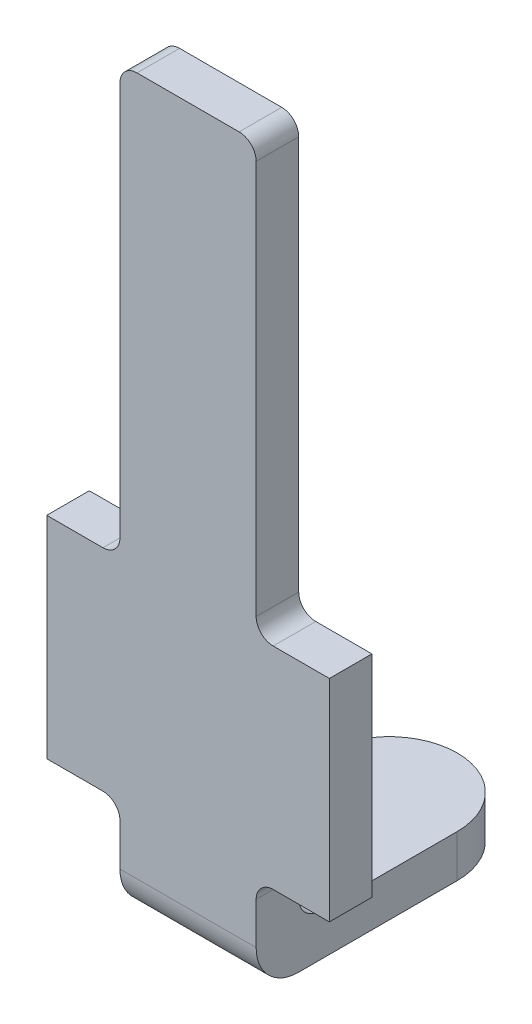
ISO-10303-21;
HEADER;
FILE_DESCRIPTION(('STEP AP214'),'2;1');
FILE_NAME('part.step','',(''),(''),'','','');
FILE_SCHEMA(('AUTOMOTIVE_DESIGN { 1 0 10303 214 1 1 1 1 }'));
ENDSEC;
DATA;
#1=APPLICATION_CONTEXT('core data for automotive mechanical design processes');
#2=APPLICATION_PROTOCOL_DEFINITION('international standard','automotive_design',2000,#1);
#3=PRODUCT_CONTEXT('',#1,'mechanical');
#4=PRODUCT('Part','Part','',(#3));
#5=PRODUCT_RELATED_PRODUCT_CATEGORY('part','',(#4));
#6=PRODUCT_DEFINITION_FORMATION('','',#4);
#7=PRODUCT_DEFINITION_CONTEXT('part definition',#1,'design');
#8=PRODUCT_DEFINITION('design','',#6,#7);
#9=PRODUCT_DEFINITION_SHAPE('','',#8);
#10=(LENGTH_UNIT() NAMED_UNIT(*) SI_UNIT(.MILLI.,.METRE.));
#11=(NAMED_UNIT(*) PLANE_ANGLE_UNIT() SI_UNIT($,.RADIAN.));
#12=(NAMED_UNIT(*) SI_UNIT($,.STERADIAN.) SOLID_ANGLE_UNIT());
#13=UNCERTAINTY_MEASURE_WITH_UNIT(LENGTH_MEASURE(1.E-05),#10,'distance_accuracy_value','');
#14=(GEOMETRIC_REPRESENTATION_CONTEXT(3) GLOBAL_UNCERTAINTY_ASSIGNED_CONTEXT((#13)) GLOBAL_UNIT_ASSIGNED_CONTEXT((#10,
#11,#12)) REPRESENTATION_CONTEXT('',''));
#15=CARTESIAN_POINT('',(0.,0.,0.));
#16=DIRECTION('',(0.,0.,1.));
#17=DIRECTION('',(1.,0.,0.));
#18=AXIS2_PLACEMENT_3D('',#15,#16,#17);
#19=CARTESIAN_POINT('',(0.77,1.48437551370885,-0.748999999999983));
#20=DIRECTION('',(0.,0.,-1.));
#21=DIRECTION('',(1.,0.,0.));
#22=AXIS2_PLACEMENT_3D('',#19,#20,#21);
#23=CYLINDRICAL_SURFACE('',#22,0.1);
#24=CARTESIAN_POINT('',(0.77,1.48437551370885,-0.498999999999983));
#25=DIRECTION('',(0.,0.,1.));
#26=DIRECTION('',(1.,0.,0.));
#27=AXIS2_PLACEMENT_3D('',#24,#25,#26);
#28=CIRCLE('',#27,0.1);
#29=CARTESIAN_POINT('',(0.77,1.38437551370885,-0.499000000000012));
#30=VERTEX_POINT('',#29);
#31=CARTESIAN_POINT('',(0.87,1.48437551370885,-0.498999999999983));
#32=VERTEX_POINT('',#31);
#33=EDGE_CURVE('E243',#30,#32,#28,.T.);
#34=ORIENTED_EDGE('',*,*,#33,.T.);
#35=DIRECTION('',(0.,0.,-1.));
#36=VECTOR('',#35,1.);
#37=CARTESIAN_POINT('',(0.87,1.48437551370885,-0.748999999999983));
#38=LINE('',#37,#36);
#39=CARTESIAN_POINT('',(0.87,1.48437551370885,-0.748999999999983));
#40=VERTEX_POINT('',#39);
#41=EDGE_CURVE('E308',#32,#40,#38,.T.);
#42=ORIENTED_EDGE('',*,*,#41,.T.);
#43=CARTESIAN_POINT('',(0.77,1.48437551370885,-0.748999999999983));
#44=DIRECTION('',(0.,0.,-1.));
#45=DIRECTION('',(-1.,0.,0.));
#46=AXIS2_PLACEMENT_3D('',#43,#44,#45);
#47=CIRCLE('',#46,0.1);
#48=CARTESIAN_POINT('',(0.77,1.38437551370885,-0.749000000000012));
#49=VERTEX_POINT('',#48);
#50=EDGE_CURVE('E285',#40,#49,#47,.T.);
#51=ORIENTED_EDGE('',*,*,#50,.T.);
#52=DIRECTION('',(0.,0.,1.));
#53=VECTOR('',#52,1.);
#54=CARTESIAN_POINT('',(0.77,1.38437551370885,-0.749000000000012));
#55=LINE('',#54,#53);
#56=EDGE_CURVE('E191',#49,#30,#55,.T.);
#57=ORIENTED_EDGE('',*,*,#56,.T.);
#58=EDGE_LOOP('',(#34,#42,#51,#57));
#59=FACE_BOUND('',#58,.T.);
#60=ADVANCED_FACE('F16',(#59),#23,.F.);
#61=CARTESIAN_POINT('',(1.77,1.48437551370885,-0.749000000000014));
#62=DIRECTION('',(0.,0.,1.));
#63=DIRECTION('',(-1.,0.,0.));
#64=AXIS2_PLACEMENT_3D('',#61,#62,#63);
#65=CYLINDRICAL_SURFACE('',#64,0.1);
#66=CARTESIAN_POINT('',(1.77,1.48437551370885,-0.498999999999985));
#67=DIRECTION('',(0.,0.,1.));
#68=DIRECTION('',(1.,0.,0.));
#69=AXIS2_PLACEMENT_3D('',#66,#67,#68);
#70=CIRCLE('',#69,0.1);
#71=CARTESIAN_POINT('',(1.67,1.48437551370885,-0.498999999999984));
#72=VERTEX_POINT('',#71);
#73=CARTESIAN_POINT('',(1.77,1.38437551370885,-0.499000000000013));
#74=VERTEX_POINT('',#73);
#75=EDGE_CURVE('E295',#72,#74,#70,.T.);
#76=ORIENTED_EDGE('',*,*,#75,.T.);
#77=DIRECTION('',(0.,0.,-1.));
#78=VECTOR('',#77,1.);
#79=CARTESIAN_POINT('',(1.77,1.38437551370885,-0.748999999999984));
#80=LINE('',#79,#78);
#81=CARTESIAN_POINT('',(1.77,1.38437551370885,-0.749000000000014));
#82=VERTEX_POINT('',#81);
#83=EDGE_CURVE('E41',#74,#82,#80,.T.);
#84=ORIENTED_EDGE('',*,*,#83,.T.);
#85=CARTESIAN_POINT('',(1.77,1.48437551370885,-0.748999999999984));
#86=DIRECTION('',(0.,0.,-1.));
#87=DIRECTION('',(-1.,0.,0.));
#88=AXIS2_PLACEMENT_3D('',#85,#86,#87);
#89=CIRCLE('',#88,0.1);
#90=CARTESIAN_POINT('',(1.67,1.48437551370885,-0.748999999999984));
#91=VERTEX_POINT('',#90);
#92=EDGE_CURVE('E424',#82,#91,#89,.T.);
#93=ORIENTED_EDGE('',*,*,#92,.T.);
#94=DIRECTION('',(0.,0.,1.));
#95=VECTOR('',#94,1.);
#96=CARTESIAN_POINT('',(1.67,1.48437551370885,-0.498999999999984));
#97=LINE('',#96,#95);
#98=EDGE_CURVE('E289',#91,#72,#97,.T.);
#99=ORIENTED_EDGE('',*,*,#98,.T.);
#100=EDGE_LOOP('',(#76,#84,#93,#99));
#101=FACE_BOUND('',#100,.T.);
#102=ADVANCED_FACE('F678',(#101),#65,.F.);
#103=CARTESIAN_POINT('',(0.77,0.0459658151929143,-0.749000000000012));
#104=DIRECTION('',(0.,0.,1.));
#105=DIRECTION('',(-1.,0.,0.));
#106=AXIS2_PLACEMENT_3D('',#103,#104,#105);
#107=CYLINDRICAL_SURFACE('',#106,0.1);
#108=CARTESIAN_POINT('',(0.77,0.0459658151929143,-0.498999999999983));
#109=DIRECTION('',(0.,0.,1.));
#110=DIRECTION('',(1.,0.,0.));
#111=AXIS2_PLACEMENT_3D('',#108,#109,#110);
#112=CIRCLE('',#111,0.1);
#113=CARTESIAN_POINT('',(0.87,0.0459658151929143,-0.498999999999983));
#114=VERTEX_POINT('',#113);
#115=CARTESIAN_POINT('',(0.77,0.145965815192914,-0.499000000000012));
#116=VERTEX_POINT('',#115);
#117=EDGE_CURVE('E299',#114,#116,#112,.T.);
#118=ORIENTED_EDGE('',*,*,#117,.T.);
#119=DIRECTION('',(0.,0.,-1.));
#120=VECTOR('',#119,1.);
#121=CARTESIAN_POINT('',(0.77,0.145965815192914,-0.748999999999983));
#122=LINE('',#121,#120);
#123=CARTESIAN_POINT('',(0.77,0.145965815192914,-0.749000000000012));
#124=VERTEX_POINT('',#123);
#125=EDGE_CURVE('E398',#116,#124,#122,.T.);
#126=ORIENTED_EDGE('',*,*,#125,.T.);
#127=CARTESIAN_POINT('',(0.77,0.0459658151929143,-0.748999999999983));
#128=DIRECTION('',(0.,0.,-1.));
#129=DIRECTION('',(-1.,0.,0.));
#130=AXIS2_PLACEMENT_3D('',#127,#128,#129);
#131=CIRCLE('',#130,0.1);
#132=CARTESIAN_POINT('',(0.87,0.0459658151929143,-0.748999999999983));
#133=VERTEX_POINT('',#132);
#134=EDGE_CURVE('E340',#124,#133,#131,.T.);
#135=ORIENTED_EDGE('',*,*,#134,.T.);
#136=DIRECTION('',(0.,0.,1.));
#137=VECTOR('',#136,1.);
#138=CARTESIAN_POINT('',(0.87,0.0459658151929143,-0.499000000000012));
#139=LINE('',#138,#137);
#140=EDGE_CURVE('E370',#133,#114,#139,.T.);
#141=ORIENTED_EDGE('',*,*,#140,.T.);
#142=EDGE_LOOP('',(#118,#126,#135,#141));
#143=FACE_BOUND('',#142,.T.);
#144=ADVANCED_FACE('F682',(#143),#107,.F.);
#145=CARTESIAN_POINT('',(1.77,0.0459658151929143,-0.748999999999984));
#146=DIRECTION('',(0.,0.,-1.));
#147=DIRECTION('',(1.,0.,0.));
#148=AXIS2_PLACEMENT_3D('',#145,#146,#147);
#149=CYLINDRICAL_SURFACE('',#148,0.1);
#150=CARTESIAN_POINT('',(1.77,0.0459658151929143,-0.498999999999984));
#151=DIRECTION('',(0.,0.,1.));
#152=DIRECTION('',(1.,0.,0.));
#153=AXIS2_PLACEMENT_3D('',#150,#151,#152);
#154=CIRCLE('',#153,0.1);
#155=CARTESIAN_POINT('',(1.77,0.145965815192914,-0.499000000000013));
#156=VERTEX_POINT('',#155);
#157=CARTESIAN_POINT('',(1.67,0.0459658151929143,-0.498999999999984));
#158=VERTEX_POINT('',#157);
#159=EDGE_CURVE('E430',#156,#158,#154,.T.);
#160=ORIENTED_EDGE('',*,*,#159,.T.);
#161=DIRECTION('',(0.,0.,-1.));
#162=VECTOR('',#161,1.);
#163=CARTESIAN_POINT('',(1.67,0.0459658151929143,-0.748999999999984));
#164=LINE('',#163,#162);
#165=CARTESIAN_POINT('',(1.67,0.0459658151929143,-0.748999999999984));
#166=VERTEX_POINT('',#165);
#167=EDGE_CURVE('E276',#158,#166,#164,.T.);
#168=ORIENTED_EDGE('',*,*,#167,.T.);
#169=CARTESIAN_POINT('',(1.77,0.0459658151929143,-0.748999999999984));
#170=DIRECTION('',(0.,0.,-1.));
#171=DIRECTION('',(-1.,0.,0.));
#172=AXIS2_PLACEMENT_3D('',#169,#170,#171);
#173=CIRCLE('',#172,0.1);
#174=CARTESIAN_POINT('',(1.77,0.145965815192914,-0.749000000000013));
#175=VERTEX_POINT('',#174);
#176=EDGE_CURVE('E441',#166,#175,#173,.T.);
#177=ORIENTED_EDGE('',*,*,#176,.T.);
#178=DIRECTION('',(0.,0.,1.));
#179=VECTOR('',#178,1.);
#180=CARTESIAN_POINT('',(1.77,0.145965815192914,-0.749000000000013));
#181=LINE('',#180,#179);
#182=EDGE_CURVE('E11',#175,#156,#181,.T.);
#183=ORIENTED_EDGE('',*,*,#182,.T.);
#184=EDGE_LOOP('',(#160,#168,#177,#183));
#185=FACE_BOUND('',#184,.T.);
#186=ADVANCED_FACE('F735',(#185),#149,.F.);
#187=CARTESIAN_POINT('',(0.97,3.8,-0.748999999999983));
#188=DIRECTION('',(0.,0.,1.));
#189=DIRECTION('',(-1.,0.,0.));
#190=AXIS2_PLACEMENT_3D('',#187,#188,#189);
#191=CYLINDRICAL_SURFACE('',#190,0.1);
#192=CARTESIAN_POINT('',(0.97,3.8,-0.498999999999984));
#193=DIRECTION('',(0.,0.,-1.));
#194=DIRECTION('',(1.,0.,0.));
#195=AXIS2_PLACEMENT_3D('',#192,#193,#194);
#196=CIRCLE('',#195,0.1);
#197=CARTESIAN_POINT('',(0.87,3.8,-0.498999999999984));
#198=VERTEX_POINT('',#197);
#199=CARTESIAN_POINT('',(0.97,3.9,-0.498999999999984));
#200=VERTEX_POINT('',#199);
#201=EDGE_CURVE('E231',#198,#200,#196,.T.);
#202=ORIENTED_EDGE('',*,*,#201,.T.);
#203=DIRECTION('',(0.,0.,-1.));
#204=VECTOR('',#203,1.);
#205=CARTESIAN_POINT('',(0.97,3.9,-0.748999999999983));
#206=LINE('',#205,#204);
#207=CARTESIAN_POINT('',(0.97,3.9,-0.748999999999983));
#208=VERTEX_POINT('',#207);
#209=EDGE_CURVE('E235',#200,#208,#206,.T.);
#210=ORIENTED_EDGE('',*,*,#209,.T.);
#211=CARTESIAN_POINT('',(0.97,3.8,-0.748999999999983));
#212=DIRECTION('',(0.,0.,1.));
#213=DIRECTION('',(-1.,0.,0.));
#214=AXIS2_PLACEMENT_3D('',#211,#212,#213);
#215=CIRCLE('',#214,0.1);
#216=CARTESIAN_POINT('',(0.87,3.8,-0.748999999999983));
#217=VERTEX_POINT('',#216);
#218=EDGE_CURVE('E281',#208,#217,#215,.T.);
#219=ORIENTED_EDGE('',*,*,#218,.T.);
#220=DIRECTION('',(0.,0.,1.));
#221=VECTOR('',#220,1.);
#222=CARTESIAN_POINT('',(0.87,3.8,-0.498999999999984));
#223=LINE('',#222,#221);
#224=EDGE_CURVE('E238',#217,#198,#223,.T.);
#225=ORIENTED_EDGE('',*,*,#224,.T.);
#226=EDGE_LOOP('',(#202,#210,#219,#225));
#227=FACE_BOUND('',#226,.T.);
#228=ADVANCED_FACE('F233',(#227),#191,.T.);
#229=CARTESIAN_POINT('',(1.57,3.8,-0.748999999999984));
#230=DIRECTION('',(0.,0.,-1.));
#231=DIRECTION('',(1.,0.,0.));
#232=AXIS2_PLACEMENT_3D('',#229,#230,#231);
#233=CYLINDRICAL_SURFACE('',#232,0.1);
#234=CARTESIAN_POINT('',(1.57,3.8,-0.498999999999985));
#235=DIRECTION('',(0.,0.,-1.));
#236=DIRECTION('',(1.,0.,0.));
#237=AXIS2_PLACEMENT_3D('',#234,#235,#236);
#238=CIRCLE('',#237,0.1);
#239=CARTESIAN_POINT('',(1.57,3.9,-0.498999999999985));
#240=VERTEX_POINT('',#239);
#241=CARTESIAN_POINT('',(1.67,3.8,-0.498999999999985));
#242=VERTEX_POINT('',#241);
#243=EDGE_CURVE('E250',#240,#242,#238,.T.);
#244=ORIENTED_EDGE('',*,*,#243,.T.);
#245=DIRECTION('',(0.,0.,-1.));
#246=VECTOR('',#245,1.);
#247=CARTESIAN_POINT('',(1.67,3.8,-0.748999999999984));
#248=LINE('',#247,#246);
#249=CARTESIAN_POINT('',(1.67,3.8,-0.748999999999984));
#250=VERTEX_POINT('',#249);
#251=EDGE_CURVE('E309',#242,#250,#248,.T.);
#252=ORIENTED_EDGE('',*,*,#251,.T.);
#253=CARTESIAN_POINT('',(1.57,3.8,-0.748999999999984));
#254=DIRECTION('',(0.,0.,1.));
#255=DIRECTION('',(-1.,0.,0.));
#256=AXIS2_PLACEMENT_3D('',#253,#254,#255);
#257=CIRCLE('',#256,0.1);
#258=CARTESIAN_POINT('',(1.57,3.9,-0.748999999999984));
#259=VERTEX_POINT('',#258);
#260=EDGE_CURVE('E284',#250,#259,#257,.T.);
#261=ORIENTED_EDGE('',*,*,#260,.T.);
#262=DIRECTION('',(0.,0.,1.));
#263=VECTOR('',#262,1.);
#264=CARTESIAN_POINT('',(1.57,3.9,-0.748999999999984));
#265=LINE('',#264,#263);
#266=EDGE_CURVE('E255',#259,#240,#265,.T.);
#267=ORIENTED_EDGE('',*,*,#266,.T.);
#268=EDGE_LOOP('',(#244,#252,#261,#267));
#269=FACE_BOUND('',#268,.T.);
#270=ADVANCED_FACE('F828',(#269),#233,.T.);
#271=CARTESIAN_POINT('',(2.1,0.,-1.00308650274883E-13));
#272=DIRECTION('',(-1.,0.,0.));
#273=DIRECTION('',(0.,1.,0.));
#274=AXIS2_PLACEMENT_3D('',#271,#272,#273);
#275=PLANE('',#274);
#276=DIRECTION('',(0.,0.,1.));
#277=VECTOR('',#276,1.);
#278=CARTESIAN_POINT('',(2.1,1.38437551370885,-0.749000000000014));
#279=LINE('',#278,#277);
#280=CARTESIAN_POINT('',(2.1,1.38437551370885,-0.749000000000014));
#281=VERTEX_POINT('',#280);
#282=CARTESIAN_POINT('',(2.1,1.38437551370885,-0.499000000000014));
#283=VERTEX_POINT('',#282);
#284=EDGE_CURVE('E292',#281,#283,#279,.T.);
#285=ORIENTED_EDGE('',*,*,#284,.T.);
#286=DIRECTION('',(0.,-1.,0.));
#287=VECTOR('',#286,1.);
#288=CARTESIAN_POINT('',(2.1,1.38437551370885,-0.499000000000014));
#289=LINE('',#288,#287);
#290=CARTESIAN_POINT('',(2.1,0.145965815192914,-0.499000000000014));
#291=VERTEX_POINT('',#290);
#292=EDGE_CURVE('E373',#283,#291,#289,.T.);
#293=ORIENTED_EDGE('',*,*,#292,.T.);
#294=DIRECTION('',(0.,0.,1.));
#295=VECTOR('',#294,1.);
#296=CARTESIAN_POINT('',(2.1,0.145965815192914,-0.749000000000014));
#297=LINE('',#296,#295);
#298=CARTESIAN_POINT('',(2.1,0.145965815192914,-0.749000000000014));
#299=VERTEX_POINT('',#298);
#300=EDGE_CURVE('E27',#299,#291,#297,.T.);
#301=ORIENTED_EDGE('',*,*,#300,.F.);
#302=DIRECTION('',(0.,-1.,0.));
#303=VECTOR('',#302,1.);
#304=CARTESIAN_POINT('',(2.1,1.38437551370885,-0.749000000000014));
#305=LINE('',#304,#303);
#306=EDGE_CURVE('E310',#281,#299,#305,.T.);
#307=ORIENTED_EDGE('',*,*,#306,.F.);
#308=EDGE_LOOP('',(#285,#293,#301,#307));
#309=FACE_BOUND('',#308,.T.);
#310=ADVANCED_FACE('F812',(#309),#275,.F.);
#311=CARTESIAN_POINT('',(0.44,0.145965815192914,-0.749000000000011));
#312=DIRECTION('',(0.,-1.,0.));
#313=DIRECTION('',(0.,0.,-1.));
#314=AXIS2_PLACEMENT_3D('',#311,#312,#313);
#315=PLANE('',#314);
#316=DIRECTION('',(1.,0.,0.));
#317=VECTOR('',#316,1.);
#318=CARTESIAN_POINT('',(0.44,0.145965815192914,-0.749000000000011));
#319=LINE('',#318,#317);
#320=EDGE_CURVE('E314',#175,#299,#319,.T.);
#321=ORIENTED_EDGE('',*,*,#320,.T.);
#322=ORIENTED_EDGE('',*,*,#300,.T.);
#323=DIRECTION('',(1.,0.,0.));
#324=VECTOR('',#323,1.);
#325=CARTESIAN_POINT('',(0.44,0.145965815192914,-0.499000000000011));
#326=LINE('',#325,#324);
#327=EDGE_CURVE('E415',#156,#291,#326,.T.);
#328=ORIENTED_EDGE('',*,*,#327,.F.);
#329=ORIENTED_EDGE('',*,*,#182,.F.);
#330=EDGE_LOOP('',(#321,#322,#328,#329));
#331=FACE_BOUND('',#330,.T.);
#332=ADVANCED_FACE('F808',(#331),#315,.T.);
#333=CARTESIAN_POINT('',(0.44,1.38437551370885,-0.749000000000012));
#334=DIRECTION('',(0.,-1.,0.));
#335=DIRECTION('',(0.,0.,-1.));
#336=AXIS2_PLACEMENT_3D('',#333,#334,#335);
#337=PLANE('',#336);
#338=DIRECTION('',(1.,0.,0.));
#339=VECTOR('',#338,1.);
#340=CARTESIAN_POINT('',(0.44,1.38437551370885,-0.499000000000011));
#341=LINE('',#340,#339);
#342=EDGE_CURVE('E298',#74,#283,#341,.T.);
#343=ORIENTED_EDGE('',*,*,#342,.T.);
#344=ORIENTED_EDGE('',*,*,#284,.F.);
#345=DIRECTION('',(1.,0.,0.));
#346=VECTOR('',#345,1.);
#347=CARTESIAN_POINT('',(0.44,1.38437551370885,-0.749000000000012));
#348=LINE('',#347,#346);
#349=EDGE_CURVE('E315',#82,#281,#348,.T.);
#350=ORIENTED_EDGE('',*,*,#349,.F.);
#351=ORIENTED_EDGE('',*,*,#83,.F.);
#352=EDGE_LOOP('',(#343,#344,#350,#351));
#353=FACE_BOUND('',#352,.T.);
#354=ADVANCED_FACE('F721',(#353),#337,.F.);
#355=CARTESIAN_POINT('',(0.44,1.38437551370885,-0.749000000000012));
#356=DIRECTION('',(0.,-1.,0.));
#357=DIRECTION('',(0.,0.,-1.));
#358=AXIS2_PLACEMENT_3D('',#355,#356,#357);
#359=PLANE('',#358);
#360=DIRECTION('',(1.,0.,0.));
#361=VECTOR('',#360,1.);
#362=CARTESIAN_POINT('',(0.44,1.38437551370885,-0.749000000000012));
#363=LINE('',#362,#361);
#364=CARTESIAN_POINT('',(0.44,1.38437551370885,-0.749000000000012));
#365=VERTEX_POINT('',#364);
#366=EDGE_CURVE('E319',#365,#49,#363,.T.);
#367=ORIENTED_EDGE('',*,*,#366,.F.);
#368=DIRECTION('',(0.,0.,1.));
#369=VECTOR('',#368,1.);
#370=CARTESIAN_POINT('',(0.44,1.38437551370885,-0.749000000000012));
#371=LINE('',#370,#369);
#372=CARTESIAN_POINT('',(0.44,1.38437551370885,-0.499000000000011));
#373=VERTEX_POINT('',#372);
#374=EDGE_CURVE('E156',#365,#373,#371,.T.);
#375=ORIENTED_EDGE('',*,*,#374,.T.);
#376=DIRECTION('',(1.,0.,0.));
#377=VECTOR('',#376,1.);
#378=CARTESIAN_POINT('',(0.44,1.38437551370885,-0.499000000000011));
#379=LINE('',#378,#377);
#380=EDGE_CURVE('E365',#373,#30,#379,.T.);
#381=ORIENTED_EDGE('',*,*,#380,.T.);
#382=ORIENTED_EDGE('',*,*,#56,.F.);
#383=EDGE_LOOP('',(#367,#375,#381,#382));
#384=FACE_BOUND('',#383,.T.);
#385=ADVANCED_FACE('F716',(#384),#359,.F.);
#386=CARTESIAN_POINT('',(0.44,0.145965815192914,-0.749000000000011));
#387=DIRECTION('',(0.,-1.,0.));
#388=DIRECTION('',(0.,0.,-1.));
#389=AXIS2_PLACEMENT_3D('',#386,#387,#388);
#390=PLANE('',#389);
#391=DIRECTION('',(1.,0.,0.));
#392=VECTOR('',#391,1.);
#393=CARTESIAN_POINT('',(0.44,0.145965815192914,-0.499000000000011));
#394=LINE('',#393,#392);
#395=CARTESIAN_POINT('',(0.44,0.145965815192914,-0.499000000000011));
#396=VERTEX_POINT('',#395);
#397=EDGE_CURVE('E303',#396,#116,#394,.T.);
#398=ORIENTED_EDGE('',*,*,#397,.F.);
#399=DIRECTION('',(0.,0.,1.));
#400=VECTOR('',#399,1.);
#401=CARTESIAN_POINT('',(0.44,0.145965815192914,-0.749000000000011));
#402=LINE('',#401,#400);
#403=CARTESIAN_POINT('',(0.44,0.145965815192914,-0.749000000000011));
#404=VERTEX_POINT('',#403);
#405=EDGE_CURVE('E142',#404,#396,#402,.T.);
#406=ORIENTED_EDGE('',*,*,#405,.F.);
#407=DIRECTION('',(1.,0.,0.));
#408=VECTOR('',#407,1.);
#409=CARTESIAN_POINT('',(0.44,0.145965815192914,-0.749000000000011));
#410=LINE('',#409,#408);
#411=EDGE_CURVE('E320',#404,#124,#410,.T.);
#412=ORIENTED_EDGE('',*,*,#411,.T.);
#413=ORIENTED_EDGE('',*,*,#125,.F.);
#414=EDGE_LOOP('',(#398,#406,#412,#413));
#415=FACE_BOUND('',#414,.T.);
#416=ADVANCED_FACE('F720',(#415),#390,.T.);
#417=CARTESIAN_POINT('',(0.44,0.,0.));
#418=DIRECTION('',(-1.,0.,0.));
#419=DIRECTION('',(0.,1.,0.));
#420=AXIS2_PLACEMENT_3D('',#417,#418,#419);
#421=PLANE('',#420);
#422=ORIENTED_EDGE('',*,*,#374,.F.);
#423=DIRECTION('',(0.,-1.,0.));
#424=VECTOR('',#423,1.);
#425=CARTESIAN_POINT('',(0.44,1.38437551370885,-0.749000000000012));
#426=LINE('',#425,#424);
#427=EDGE_CURVE('E316',#365,#404,#426,.T.);
#428=ORIENTED_EDGE('',*,*,#427,.T.);
#429=ORIENTED_EDGE('',*,*,#405,.T.);
#430=DIRECTION('',(0.,-1.,0.));
#431=VECTOR('',#430,1.);
#432=CARTESIAN_POINT('',(0.44,1.38437551370885,-0.499000000000011));
#433=LINE('',#432,#431);
#434=EDGE_CURVE('E361',#373,#396,#433,.T.);
#435=ORIENTED_EDGE('',*,*,#434,.F.);
#436=EDGE_LOOP('',(#422,#428,#429,#435));
#437=FACE_BOUND('',#436,.T.);
#438=ADVANCED_FACE('F729',(#437),#421,.T.);
#439=CARTESIAN_POINT('',(1.27,-0.2,-1.68));
#440=DIRECTION('',(0.,-1.,0.));
#441=DIRECTION('',(0.,0.,1.));
#442=AXIS2_PLACEMENT_3D('',#439,#440,#441);
#443=CYLINDRICAL_SURFACE('',#442,0.4);
#444=DIRECTION('',(0.,-1.,0.));
#445=VECTOR('',#444,1.);
#446=CARTESIAN_POINT('',(1.67,-0.2,-1.68));
#447=LINE('',#446,#445);
#448=CARTESIAN_POINT('',(1.67,-0.2,-1.68));
#449=VERTEX_POINT('',#448);
#450=CARTESIAN_POINT('',(1.67,-0.45,-1.68));
#451=VERTEX_POINT('',#450);
#452=EDGE_CURVE('E280',#449,#451,#447,.T.);
#453=ORIENTED_EDGE('',*,*,#452,.T.);
#454=CARTESIAN_POINT('',(1.27,-0.45,-1.68));
#455=DIRECTION('',(0.,1.,0.));
#456=DIRECTION('',(0.,0.,-1.));
#457=AXIS2_PLACEMENT_3D('',#454,#455,#456);
#458=CIRCLE('',#457,0.4);
#459=CARTESIAN_POINT('',(0.87,-0.45,-1.68));
#460=VERTEX_POINT('',#459);
#461=EDGE_CURVE('E275',#451,#460,#458,.T.);
#462=ORIENTED_EDGE('',*,*,#461,.T.);
#463=DIRECTION('',(0.,1.,0.));
#464=VECTOR('',#463,1.);
#465=CARTESIAN_POINT('',(0.87,-0.2,-1.68));
#466=LINE('',#465,#464);
#467=CARTESIAN_POINT('',(0.87,-0.2,-1.68));
#468=VERTEX_POINT('',#467);
#469=EDGE_CURVE('E279',#460,#468,#466,.T.);
#470=ORIENTED_EDGE('',*,*,#469,.T.);
#471=CARTESIAN_POINT('',(1.27,-0.2,-1.68));
#472=DIRECTION('',(0.,-1.,0.));
#473=DIRECTION('',(0.,0.,1.));
#474=AXIS2_PLACEMENT_3D('',#471,#472,#473);
#475=CIRCLE('',#474,0.4);
#476=EDGE_CURVE('E350',#468,#449,#475,.T.);
#477=ORIENTED_EDGE('',*,*,#476,.T.);
#478=EDGE_LOOP('',(#453,#462,#470,#477));
#479=FACE_BOUND('',#478,.T.);
#480=ADVANCED_FACE('F711',(#479),#443,.T.);
#481=CARTESIAN_POINT('',(0.87,-0.2,-0.748999999999983));
#482=DIRECTION('',(-1.,0.,0.));
#483=DIRECTION('',(0.,1.,0.));
#484=AXIS2_PLACEMENT_3D('',#481,#482,#483);
#485=PLANE('',#484);
#486=DIRECTION('',(0.,-1.,0.));
#487=VECTOR('',#486,1.);
#488=CARTESIAN_POINT('',(0.87,3.9,-0.748999999999983));
#489=LINE('',#488,#487);
#490=CARTESIAN_POINT('',(0.87,-0.0749999999999988,-0.748999999999983));
#491=VERTEX_POINT('',#490);
#492=EDGE_CURVE('E335',#133,#491,#489,.T.);
#493=ORIENTED_EDGE('',*,*,#492,.T.);
#494=CARTESIAN_POINT('',(0.87,-0.0749999999999988,-0.873999999999983));
#495=DIRECTION('',(1.,0.,0.));
#496=DIRECTION('',(0.,0.,-1.));
#497=AXIS2_PLACEMENT_3D('',#494,#495,#496);
#498=CIRCLE('',#497,0.125);
#499=CARTESIAN_POINT('',(0.87,-0.2,-0.873999999999983));
#500=VERTEX_POINT('',#499);
#501=EDGE_CURVE('E379',#491,#500,#498,.T.);
#502=ORIENTED_EDGE('',*,*,#501,.T.);
#503=DIRECTION('',(0.,0.,-1.));
#504=VECTOR('',#503,1.);
#505=CARTESIAN_POINT('',(0.87,-0.2,-0.873999999999983));
#506=LINE('',#505,#504);
#507=EDGE_CURVE('E325',#500,#468,#506,.T.);
#508=ORIENTED_EDGE('',*,*,#507,.T.);
#509=ORIENTED_EDGE('',*,*,#469,.F.);
#510=DIRECTION('',(0.,0.,1.));
#511=VECTOR('',#510,1.);
#512=CARTESIAN_POINT('',(0.87,-0.45,-0.748999999999983));
#513=LINE('',#512,#511);
#514=CARTESIAN_POINT('',(0.87,-0.45,-0.748999999999983));
#515=VERTEX_POINT('',#514);
#516=EDGE_CURVE('E346',#460,#515,#513,.T.);
#517=ORIENTED_EDGE('',*,*,#516,.T.);
#518=CARTESIAN_POINT('',(0.87,-0.2,-0.748999999999983));
#519=DIRECTION('',(-1.,0.,0.));
#520=DIRECTION('',(0.,0.,-1.));
#521=AXIS2_PLACEMENT_3D('',#518,#519,#520);
#522=CIRCLE('',#521,0.25);
#523=CARTESIAN_POINT('',(0.87,-0.2,-0.498999999999983));
#524=VERTEX_POINT('',#523);
#525=EDGE_CURVE('E341',#515,#524,#522,.T.);
#526=ORIENTED_EDGE('',*,*,#525,.T.);
#527=DIRECTION('',(0.,1.,0.));
#528=VECTOR('',#527,1.);
#529=CARTESIAN_POINT('',(0.87,3.9,-0.498999999999984));
#530=LINE('',#529,#528);
#531=EDGE_CURVE('E20',#524,#114,#530,.T.);
#532=ORIENTED_EDGE('',*,*,#531,.T.);
#533=ORIENTED_EDGE('',*,*,#140,.F.);
#534=EDGE_LOOP('',(#493,#502,#508,#509,#517,#526,#532,#533));
#535=FACE_BOUND('',#534,.T.);
#536=ADVANCED_FACE('F706',(#535),#485,.T.);
#537=CARTESIAN_POINT('',(1.67,-0.2,-0.748999999999984));
#538=DIRECTION('',(-1.,0.,0.));
#539=DIRECTION('',(0.,1.,0.));
#540=AXIS2_PLACEMENT_3D('',#537,#538,#539);
#541=PLANE('',#540);
#542=DIRECTION('',(0.,1.,0.));
#543=VECTOR('',#542,1.);
#544=CARTESIAN_POINT('',(1.67,3.9,-0.498999999999985));
#545=LINE('',#544,#543);
#546=CARTESIAN_POINT('',(1.67,-0.2,-0.498999999999984));
#547=VERTEX_POINT('',#546);
#548=EDGE_CURVE('E433',#547,#158,#545,.T.);
#549=ORIENTED_EDGE('',*,*,#548,.F.);
#550=CARTESIAN_POINT('',(1.67,-0.2,-0.748999999999984));
#551=DIRECTION('',(-1.,0.,0.));
#552=DIRECTION('',(0.,0.,-1.));
#553=AXIS2_PLACEMENT_3D('',#550,#551,#552);
#554=CIRCLE('',#553,0.25);
#555=CARTESIAN_POINT('',(1.67,-0.45,-0.748999999999984));
#556=VERTEX_POINT('',#555);
#557=EDGE_CURVE('E345',#556,#547,#554,.T.);
#558=ORIENTED_EDGE('',*,*,#557,.F.);
#559=DIRECTION('',(0.,0.,1.));
#560=VECTOR('',#559,1.);
#561=CARTESIAN_POINT('',(1.67,-0.45,-0.748999999999984));
#562=LINE('',#561,#560);
#563=EDGE_CURVE('E270',#451,#556,#562,.T.);
#564=ORIENTED_EDGE('',*,*,#563,.F.);
#565=ORIENTED_EDGE('',*,*,#452,.F.);
#566=DIRECTION('',(0.,0.,-1.));
#567=VECTOR('',#566,1.);
#568=CARTESIAN_POINT('',(1.67,-0.2,-0.873999999999984));
#569=LINE('',#568,#567);
#570=CARTESIAN_POINT('',(1.67,-0.2,-0.873999999999984));
#571=VERTEX_POINT('',#570);
#572=EDGE_CURVE('E329',#571,#449,#569,.T.);
#573=ORIENTED_EDGE('',*,*,#572,.F.);
#574=CARTESIAN_POINT('',(1.67,-0.0749999999999988,-0.873999999999984));
#575=DIRECTION('',(1.,0.,0.));
#576=DIRECTION('',(0.,0.,-1.));
#577=AXIS2_PLACEMENT_3D('',#574,#575,#576);
#578=CIRCLE('',#577,0.125);
#579=CARTESIAN_POINT('',(1.67,-0.0749999999999988,-0.748999999999984));
#580=VERTEX_POINT('',#579);
#581=EDGE_CURVE('E376',#580,#571,#578,.T.);
#582=ORIENTED_EDGE('',*,*,#581,.F.);
#583=DIRECTION('',(0.,-1.,0.));
#584=VECTOR('',#583,1.);
#585=CARTESIAN_POINT('',(1.67,3.9,-0.748999999999984));
#586=LINE('',#585,#584);
#587=EDGE_CURVE('E336',#166,#580,#586,.T.);
#588=ORIENTED_EDGE('',*,*,#587,.F.);
#589=ORIENTED_EDGE('',*,*,#167,.F.);
#590=EDGE_LOOP('',(#549,#558,#564,#565,#573,#582,#588,#589));
#591=FACE_BOUND('',#590,.T.);
#592=ADVANCED_FACE('F710',(#591),#541,.F.);
#593=CARTESIAN_POINT('',(1.67,3.9,-0.498999999999985));
#594=DIRECTION('',(0.,0.,-1.));
#595=DIRECTION('',(-1.,0.,0.));
#596=AXIS2_PLACEMENT_3D('',#593,#594,#595);
#597=PLANE('',#596);
#598=DIRECTION('',(-1.,0.,0.));
#599=VECTOR('',#598,1.);
#600=CARTESIAN_POINT('',(1.67,3.9,-0.498999999999985));
#601=LINE('',#600,#599);
#602=EDGE_CURVE('E247',#240,#200,#601,.T.);
#603=ORIENTED_EDGE('',*,*,#602,.T.);
#604=ORIENTED_EDGE('',*,*,#201,.F.);
#605=DIRECTION('',(0.,1.,0.));
#606=VECTOR('',#605,1.);
#607=CARTESIAN_POINT('',(0.87,3.9,-0.498999999999984));
#608=LINE('',#607,#606);
#609=EDGE_CURVE('E399',#32,#198,#608,.T.);
#610=ORIENTED_EDGE('',*,*,#609,.F.);
#611=ORIENTED_EDGE('',*,*,#33,.F.);
#612=ORIENTED_EDGE('',*,*,#380,.F.);
#613=ORIENTED_EDGE('',*,*,#434,.T.);
#614=ORIENTED_EDGE('',*,*,#397,.T.);
#615=ORIENTED_EDGE('',*,*,#117,.F.);
#616=ORIENTED_EDGE('',*,*,#531,.F.);
#617=DIRECTION('',(-1.,0.,0.));
#618=VECTOR('',#617,1.);
#619=CARTESIAN_POINT('',(1.67,-0.2,-0.498999999999984));
#620=LINE('',#619,#618);
#621=EDGE_CURVE('E244',#547,#524,#620,.T.);
#622=ORIENTED_EDGE('',*,*,#621,.F.);
#623=ORIENTED_EDGE('',*,*,#548,.T.);
#624=ORIENTED_EDGE('',*,*,#159,.F.);
#625=ORIENTED_EDGE('',*,*,#327,.T.);
#626=ORIENTED_EDGE('',*,*,#292,.F.);
#627=ORIENTED_EDGE('',*,*,#342,.F.);
#628=ORIENTED_EDGE('',*,*,#75,.F.);
#629=DIRECTION('',(0.,1.,0.));
#630=VECTOR('',#629,1.);
#631=CARTESIAN_POINT('',(1.67,3.9,-0.498999999999985));
#632=LINE('',#631,#630);
#633=EDGE_CURVE('E286',#72,#242,#632,.T.);
#634=ORIENTED_EDGE('',*,*,#633,.T.);
#635=ORIENTED_EDGE('',*,*,#243,.F.);
#636=EDGE_LOOP('',(#603,#604,#610,#611,#612,#613,#614,#615,#616,#622,#623,#624,#625,#626,#627,
#628,#634,#635));
#637=FACE_BOUND('',#636,.T.);
#638=ADVANCED_FACE('F248',(#637),#597,.F.);
#639=CARTESIAN_POINT('',(1.67,-0.2,-0.748999999999984));
#640=DIRECTION('',(-1.,0.,0.));
#641=DIRECTION('',(0.,0.,-1.));
#642=AXIS2_PLACEMENT_3D('',#639,#640,#641);
#643=CYLINDRICAL_SURFACE('',#642,0.25);
#644=ORIENTED_EDGE('',*,*,#525,.F.);
#645=DIRECTION('',(-1.,0.,0.));
#646=VECTOR('',#645,1.);
#647=CARTESIAN_POINT('',(1.67,-0.45,-0.748999999999984));
#648=LINE('',#647,#646);
#649=EDGE_CURVE('E274',#556,#515,#648,.T.);
#650=ORIENTED_EDGE('',*,*,#649,.F.);
#651=ORIENTED_EDGE('',*,*,#557,.T.);
#652=ORIENTED_EDGE('',*,*,#621,.T.);
#653=EDGE_LOOP('',(#644,#650,#651,#652));
#654=FACE_BOUND('',#653,.T.);
#655=ADVANCED_FACE('F747',(#654),#643,.T.);
#656=CARTESIAN_POINT('',(1.67,-0.45,-0.748999999999984));
#657=DIRECTION('',(0.,1.,0.));
#658=DIRECTION('',(0.,0.,-1.));
#659=AXIS2_PLACEMENT_3D('',#656,#657,#658);
#660=PLANE('',#659);
#661=ORIENTED_EDGE('',*,*,#461,.F.);
#662=ORIENTED_EDGE('',*,*,#563,.T.);
#663=ORIENTED_EDGE('',*,*,#649,.T.);
#664=ORIENTED_EDGE('',*,*,#516,.F.);
#665=EDGE_LOOP('',(#661,#662,#663,#664));
#666=FACE_BOUND('',#665,.T.);
#667=ADVANCED_FACE('F794',(#666),#660,.F.);
#668=CARTESIAN_POINT('',(1.67,-0.2,-0.873999999999984));
#669=DIRECTION('',(0.,-1.,0.));
#670=DIRECTION('',(-1.,0.,0.));
#671=AXIS2_PLACEMENT_3D('',#668,#669,#670);
#672=PLANE('',#671);
#673=ORIENTED_EDGE('',*,*,#507,.F.);
#674=DIRECTION('',(-1.,0.,0.));
#675=VECTOR('',#674,1.);
#676=CARTESIAN_POINT('',(1.67,-0.2,-0.873999999999984));
#677=LINE('',#676,#675);
#678=EDGE_CURVE('E330',#571,#500,#677,.T.);
#679=ORIENTED_EDGE('',*,*,#678,.F.);
#680=ORIENTED_EDGE('',*,*,#572,.T.);
#681=ORIENTED_EDGE('',*,*,#476,.F.);
#682=EDGE_LOOP('',(#673,#679,#680,#681));
#683=FACE_BOUND('',#682,.T.);
#684=ADVANCED_FACE('F770',(#683),#672,.F.);
#685=CARTESIAN_POINT('',(1.67,-0.0749999999999988,-0.873999999999984));
#686=DIRECTION('',(-1.,0.,0.));
#687=DIRECTION('',(0.,0.,-1.));
#688=AXIS2_PLACEMENT_3D('',#685,#686,#687);
#689=CYLINDRICAL_SURFACE('',#688,0.125);
#690=ORIENTED_EDGE('',*,*,#501,.F.);
#691=DIRECTION('',(-1.,0.,0.));
#692=VECTOR('',#691,1.);
#693=CARTESIAN_POINT('',(1.67,-0.0749999999999988,-0.748999999999984));
#694=LINE('',#693,#692);
#695=EDGE_CURVE('E331',#580,#491,#694,.T.);
#696=ORIENTED_EDGE('',*,*,#695,.F.);
#697=ORIENTED_EDGE('',*,*,#581,.T.);
#698=ORIENTED_EDGE('',*,*,#678,.T.);
#699=EDGE_LOOP('',(#690,#696,#697,#698));
#700=FACE_BOUND('',#699,.T.);
#701=ADVANCED_FACE('F700',(#700),#689,.F.);
#702=CARTESIAN_POINT('',(1.67,3.9,-0.748999999999984));
#703=DIRECTION('',(0.,0.,1.));
#704=DIRECTION('',(1.,0.,0.));
#705=AXIS2_PLACEMENT_3D('',#702,#703,#704);
#706=PLANE('',#705);
#707=DIRECTION('',(0.,-1.,0.));
#708=VECTOR('',#707,1.);
#709=CARTESIAN_POINT('',(1.67,3.9,-0.748999999999984));
#710=LINE('',#709,#708);
#711=EDGE_CURVE('E354',#250,#91,#710,.T.);
#712=ORIENTED_EDGE('',*,*,#711,.T.);
#713=ORIENTED_EDGE('',*,*,#92,.F.);
#714=ORIENTED_EDGE('',*,*,#349,.T.);
#715=ORIENTED_EDGE('',*,*,#306,.T.);
#716=ORIENTED_EDGE('',*,*,#320,.F.);
#717=ORIENTED_EDGE('',*,*,#176,.F.);
#718=ORIENTED_EDGE('',*,*,#587,.T.);
#719=ORIENTED_EDGE('',*,*,#695,.T.);
#720=ORIENTED_EDGE('',*,*,#492,.F.);
#721=ORIENTED_EDGE('',*,*,#134,.F.);
#722=ORIENTED_EDGE('',*,*,#411,.F.);
#723=ORIENTED_EDGE('',*,*,#427,.F.);
#724=ORIENTED_EDGE('',*,*,#366,.T.);
#725=ORIENTED_EDGE('',*,*,#50,.F.);
#726=DIRECTION('',(0.,-1.,0.));
#727=VECTOR('',#726,1.);
#728=CARTESIAN_POINT('',(0.87,3.9,-0.748999999999983));
#729=LINE('',#728,#727);
#730=EDGE_CURVE('E304',#217,#40,#729,.T.);
#731=ORIENTED_EDGE('',*,*,#730,.F.);
#732=ORIENTED_EDGE('',*,*,#218,.F.);
#733=DIRECTION('',(-1.,0.,0.));
#734=VECTOR('',#733,1.);
#735=CARTESIAN_POINT('',(1.67,3.9,-0.748999999999984));
#736=LINE('',#735,#734);
#737=EDGE_CURVE('E259',#259,#208,#736,.T.);
#738=ORIENTED_EDGE('',*,*,#737,.F.);
#739=ORIENTED_EDGE('',*,*,#260,.F.);
#740=EDGE_LOOP('',(#712,#713,#714,#715,#716,#717,#718,#719,#720,#721,#722,#723,#724,#725,#731,
#732,#738,#739));
#741=FACE_BOUND('',#740,.T.);
#742=ADVANCED_FACE('F692',(#741),#706,.F.);
#743=CARTESIAN_POINT('',(1.67,3.9,-0.748999999999984));
#744=DIRECTION('',(0.,-1.,0.));
#745=DIRECTION('',(0.,0.,-1.));
#746=AXIS2_PLACEMENT_3D('',#743,#744,#745);
#747=PLANE('',#746);
#748=ORIENTED_EDGE('',*,*,#737,.T.);
#749=ORIENTED_EDGE('',*,*,#209,.F.);
#750=ORIENTED_EDGE('',*,*,#602,.F.);
#751=ORIENTED_EDGE('',*,*,#266,.F.);
#752=EDGE_LOOP('',(#748,#749,#750,#751));
#753=FACE_BOUND('',#752,.T.);
#754=ADVANCED_FACE('F257',(#753),#747,.F.);
#755=CARTESIAN_POINT('',(0.87,-0.2,-0.748999999999983));
#756=DIRECTION('',(-1.,0.,0.));
#757=DIRECTION('',(0.,1.,0.));
#758=AXIS2_PLACEMENT_3D('',#755,#756,#757);
#759=PLANE('',#758);
#760=ORIENTED_EDGE('',*,*,#730,.T.);
#761=ORIENTED_EDGE('',*,*,#41,.F.);
#762=ORIENTED_EDGE('',*,*,#609,.T.);
#763=ORIENTED_EDGE('',*,*,#224,.F.);
#764=EDGE_LOOP('',(#760,#761,#762,#763));
#765=FACE_BOUND('',#764,.T.);
#766=ADVANCED_FACE('F691',(#765),#759,.T.);
#767=CARTESIAN_POINT('',(1.67,-0.2,-0.748999999999984));
#768=DIRECTION('',(-1.,0.,0.));
#769=DIRECTION('',(0.,1.,0.));
#770=AXIS2_PLACEMENT_3D('',#767,#768,#769);
#771=PLANE('',#770);
#772=ORIENTED_EDGE('',*,*,#633,.F.);
#773=ORIENTED_EDGE('',*,*,#98,.F.);
#774=ORIENTED_EDGE('',*,*,#711,.F.);
#775=ORIENTED_EDGE('',*,*,#251,.F.);
#776=EDGE_LOOP('',(#772,#773,#774,#775));
#777=FACE_BOUND('',#776,.T.);
#778=ADVANCED_FACE('F18',(#777),#771,.F.);
#779=CLOSED_SHELL('',(#60,#102,#144,#186,#228,#270,#310,#332,#354,#385,#416,#438,#480,#536,#592,
#638,#655,#667,#684,#701,#742,#754,#766,#778));
#780=MANIFOLD_SOLID_BREP('B1',#779);
#781=ADVANCED_BREP_SHAPE_REPRESENTATION('',(#18,#780),#14);
#782=SHAPE_DEFINITION_REPRESENTATION(#9,#781);
ENDSEC;
END-ISO-10303-21;
